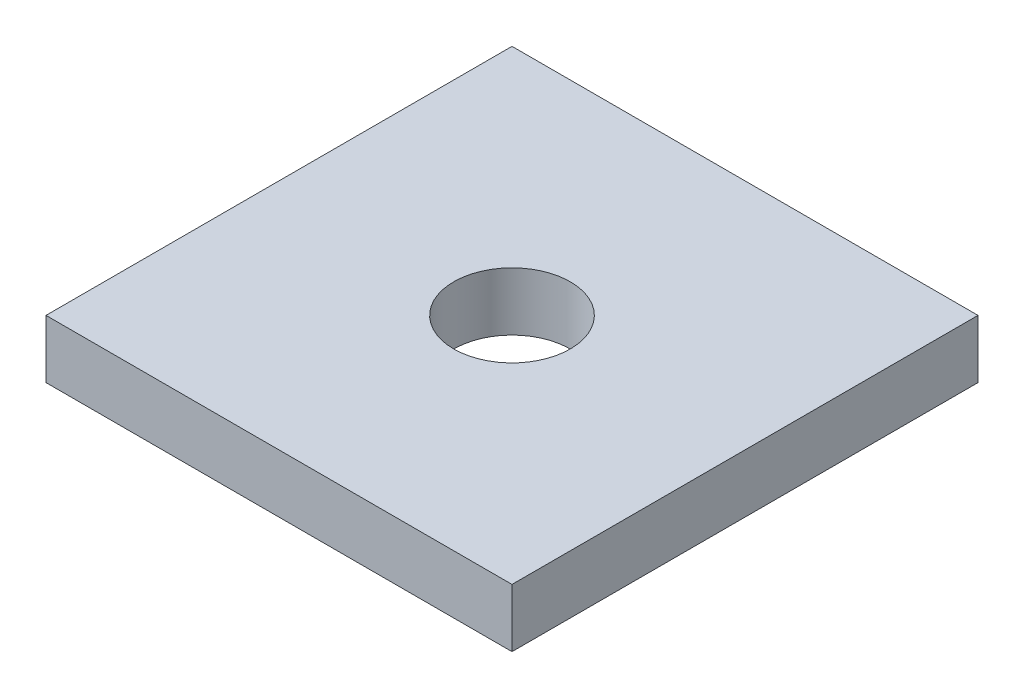
ISO-10303-21;
HEADER;
FILE_DESCRIPTION(('STEP AP214'),'2;1');
FILE_NAME('part.step','',(''),(''),'','','');
FILE_SCHEMA(('AUTOMOTIVE_DESIGN { 1 0 10303 214 1 1 1 1 }'));
ENDSEC;
DATA;
#1=APPLICATION_CONTEXT('core data for automotive mechanical design processes');
#2=APPLICATION_PROTOCOL_DEFINITION('international standard','automotive_design',2000,#1);
#3=PRODUCT_CONTEXT('',#1,'mechanical');
#4=PRODUCT('Part','Part','',(#3));
#5=PRODUCT_RELATED_PRODUCT_CATEGORY('part','',(#4));
#6=PRODUCT_DEFINITION_FORMATION('','',#4);
#7=PRODUCT_DEFINITION_CONTEXT('part definition',#1,'design');
#8=PRODUCT_DEFINITION('design','',#6,#7);
#9=PRODUCT_DEFINITION_SHAPE('','',#8);
#10=(LENGTH_UNIT() NAMED_UNIT(*) SI_UNIT(.MILLI.,.METRE.));
#11=(NAMED_UNIT(*) PLANE_ANGLE_UNIT() SI_UNIT($,.RADIAN.));
#12=(NAMED_UNIT(*) SI_UNIT($,.STERADIAN.) SOLID_ANGLE_UNIT());
#13=UNCERTAINTY_MEASURE_WITH_UNIT(LENGTH_MEASURE(1.E-05),#10,'distance_accuracy_value','');
#14=(GEOMETRIC_REPRESENTATION_CONTEXT(3) GLOBAL_UNCERTAINTY_ASSIGNED_CONTEXT((#13)) GLOBAL_UNIT_ASSIGNED_CONTEXT((#10,
#11,#12)) REPRESENTATION_CONTEXT('',''));
#15=CARTESIAN_POINT('',(0.,0.,0.));
#16=DIRECTION('',(0.,0.,1.));
#17=DIRECTION('',(1.,0.,0.));
#18=AXIS2_PLACEMENT_3D('',#15,#16,#17);
#19=CARTESIAN_POINT('',(-25.4,6.35,25.4));
#20=DIRECTION('',(0.,-1.,0.));
#21=DIRECTION('',(0.,0.,-1.));
#22=AXIS2_PLACEMENT_3D('',#19,#20,#21);
#23=PLANE('',#22);
#24=DIRECTION('',(0.,0.,1.));
#25=VECTOR('',#24,1.);
#26=CARTESIAN_POINT('',(-25.4,6.35,-25.4));
#27=LINE('',#26,#25);
#28=CARTESIAN_POINT('',(-25.4,6.35,-25.4));
#29=VERTEX_POINT('',#28);
#30=CARTESIAN_POINT('',(-25.4,6.35,25.4));
#31=VERTEX_POINT('',#30);
#32=EDGE_CURVE('E86',#29,#31,#27,.T.);
#33=ORIENTED_EDGE('',*,*,#32,.T.);
#34=DIRECTION('',(1.,0.,0.));
#35=VECTOR('',#34,1.);
#36=CARTESIAN_POINT('',(25.4,6.35,25.4));
#37=LINE('',#36,#35);
#38=CARTESIAN_POINT('',(25.4,6.35,25.4));
#39=VERTEX_POINT('',#38);
#40=EDGE_CURVE('E81',#31,#39,#37,.T.);
#41=ORIENTED_EDGE('',*,*,#40,.T.);
#42=DIRECTION('',(0.,0.,-1.));
#43=VECTOR('',#42,1.);
#44=CARTESIAN_POINT('',(25.4,6.35,-25.4));
#45=LINE('',#44,#43);
#46=CARTESIAN_POINT('',(25.4,6.35,-25.4));
#47=VERTEX_POINT('',#46);
#48=EDGE_CURVE('E84',#39,#47,#45,.T.);
#49=ORIENTED_EDGE('',*,*,#48,.T.);
#50=DIRECTION('',(-1.,0.,0.));
#51=VECTOR('',#50,1.);
#52=CARTESIAN_POINT('',(25.4,6.35,-25.4));
#53=LINE('',#52,#51);
#54=EDGE_CURVE('E51',#47,#29,#53,.T.);
#55=ORIENTED_EDGE('',*,*,#54,.T.);
#56=EDGE_LOOP('',(#33,#41,#49,#55));
#57=FACE_BOUND('',#56,.T.);
#58=CARTESIAN_POINT('',(0.,6.35,0.));
#59=DIRECTION('',(0.,1.,0.));
#60=DIRECTION('',(0.,0.,1.));
#61=AXIS2_PLACEMENT_3D('',#58,#59,#60);
#62=CIRCLE('',#61,6.35);
#63=CARTESIAN_POINT('',(0.,6.35,6.34999999999999));
#64=VERTEX_POINT('',#63);
#65=EDGE_CURVE('E101',#64,#64,#62,.T.);
#66=ORIENTED_EDGE('',*,*,#65,.F.);
#67=EDGE_LOOP('',(#66));
#68=FACE_BOUND('',#67,.T.);
#69=ADVANCED_FACE('F34',(#57,#68),#23,.F.);
#70=CARTESIAN_POINT('',(-25.4,0.,25.4));
#71=DIRECTION('',(0.,-1.,0.));
#72=DIRECTION('',(0.,0.,-1.));
#73=AXIS2_PLACEMENT_3D('',#70,#71,#72);
#74=PLANE('',#73);
#75=DIRECTION('',(0.,0.,1.));
#76=VECTOR('',#75,1.);
#77=CARTESIAN_POINT('',(-25.4,0.,-25.4));
#78=LINE('',#77,#76);
#79=CARTESIAN_POINT('',(-25.4,0.,-25.4));
#80=VERTEX_POINT('',#79);
#81=CARTESIAN_POINT('',(-25.4,0.,25.4));
#82=VERTEX_POINT('',#81);
#83=EDGE_CURVE('E98',#80,#82,#78,.T.);
#84=ORIENTED_EDGE('',*,*,#83,.F.);
#85=DIRECTION('',(-1.,0.,0.));
#86=VECTOR('',#85,1.);
#87=CARTESIAN_POINT('',(25.4,0.,-25.4));
#88=LINE('',#87,#86);
#89=CARTESIAN_POINT('',(25.4,0.,-25.4));
#90=VERTEX_POINT('',#89);
#91=EDGE_CURVE('E74',#90,#80,#88,.T.);
#92=ORIENTED_EDGE('',*,*,#91,.F.);
#93=DIRECTION('',(0.,0.,-1.));
#94=VECTOR('',#93,1.);
#95=CARTESIAN_POINT('',(25.4,0.,-25.4));
#96=LINE('',#95,#94);
#97=CARTESIAN_POINT('',(25.4,0.,25.4));
#98=VERTEX_POINT('',#97);
#99=EDGE_CURVE('E68',#98,#90,#96,.T.);
#100=ORIENTED_EDGE('',*,*,#99,.F.);
#101=DIRECTION('',(1.,0.,0.));
#102=VECTOR('',#101,1.);
#103=CARTESIAN_POINT('',(25.4,0.,25.4));
#104=LINE('',#103,#102);
#105=EDGE_CURVE('E90',#82,#98,#104,.T.);
#106=ORIENTED_EDGE('',*,*,#105,.F.);
#107=EDGE_LOOP('',(#84,#92,#100,#106));
#108=FACE_BOUND('',#107,.T.);
#109=CARTESIAN_POINT('',(0.,0.,0.));
#110=DIRECTION('',(0.,1.,0.));
#111=DIRECTION('',(0.,0.,1.));
#112=AXIS2_PLACEMENT_3D('',#109,#110,#111);
#113=CIRCLE('',#112,6.35);
#114=CARTESIAN_POINT('',(0.,0.,6.34999999999999));
#115=VERTEX_POINT('',#114);
#116=EDGE_CURVE('E113',#115,#115,#113,.T.);
#117=ORIENTED_EDGE('',*,*,#116,.T.);
#118=EDGE_LOOP('',(#117));
#119=FACE_BOUND('',#118,.T.);
#120=ADVANCED_FACE('F109',(#108,#119),#74,.T.);
#121=CARTESIAN_POINT('',(-25.4,6.35,-25.4));
#122=DIRECTION('',(1.,0.,0.));
#123=DIRECTION('',(0.,0.,-1.));
#124=AXIS2_PLACEMENT_3D('',#121,#122,#123);
#125=PLANE('',#124);
#126=ORIENTED_EDGE('',*,*,#83,.T.);
#127=DIRECTION('',(0.,-1.,0.));
#128=VECTOR('',#127,1.);
#129=CARTESIAN_POINT('',(-25.4,6.35,25.4));
#130=LINE('',#129,#128);
#131=EDGE_CURVE('E11',#31,#82,#130,.T.);
#132=ORIENTED_EDGE('',*,*,#131,.F.);
#133=ORIENTED_EDGE('',*,*,#32,.F.);
#134=DIRECTION('',(0.,-1.,0.));
#135=VECTOR('',#134,1.);
#136=CARTESIAN_POINT('',(-25.4,6.35,-25.4));
#137=LINE('',#136,#135);
#138=EDGE_CURVE('E94',#29,#80,#137,.T.);
#139=ORIENTED_EDGE('',*,*,#138,.T.);
#140=EDGE_LOOP('',(#126,#132,#133,#139));
#141=FACE_BOUND('',#140,.T.);
#142=ADVANCED_FACE('F36',(#141),#125,.F.);
#143=CARTESIAN_POINT('',(25.4,6.35,25.4));
#144=DIRECTION('',(0.,0.,-1.));
#145=DIRECTION('',(-1.,0.,0.));
#146=AXIS2_PLACEMENT_3D('',#143,#144,#145);
#147=PLANE('',#146);
#148=ORIENTED_EDGE('',*,*,#105,.T.);
#149=DIRECTION('',(0.,-1.,0.));
#150=VECTOR('',#149,1.);
#151=CARTESIAN_POINT('',(25.4,6.35,25.4));
#152=LINE('',#151,#150);
#153=EDGE_CURVE('E43',#39,#98,#152,.T.);
#154=ORIENTED_EDGE('',*,*,#153,.F.);
#155=ORIENTED_EDGE('',*,*,#40,.F.);
#156=ORIENTED_EDGE('',*,*,#131,.T.);
#157=EDGE_LOOP('',(#148,#154,#155,#156));
#158=FACE_BOUND('',#157,.T.);
#159=ADVANCED_FACE('F89',(#158),#147,.F.);
#160=CARTESIAN_POINT('',(25.4,6.35,-25.4));
#161=DIRECTION('',(-1.,0.,0.));
#162=DIRECTION('',(0.,0.,1.));
#163=AXIS2_PLACEMENT_3D('',#160,#161,#162);
#164=PLANE('',#163);
#165=ORIENTED_EDGE('',*,*,#99,.T.);
#166=DIRECTION('',(0.,-1.,0.));
#167=VECTOR('',#166,1.);
#168=CARTESIAN_POINT('',(25.4,6.35,-25.4));
#169=LINE('',#168,#167);
#170=EDGE_CURVE('E91',#47,#90,#169,.T.);
#171=ORIENTED_EDGE('',*,*,#170,.F.);
#172=ORIENTED_EDGE('',*,*,#48,.F.);
#173=ORIENTED_EDGE('',*,*,#153,.T.);
#174=EDGE_LOOP('',(#165,#171,#172,#173));
#175=FACE_BOUND('',#174,.T.);
#176=ADVANCED_FACE('F92',(#175),#164,.F.);
#177=CARTESIAN_POINT('',(25.4,6.35,-25.4));
#178=DIRECTION('',(0.,0.,1.));
#179=DIRECTION('',(1.,0.,0.));
#180=AXIS2_PLACEMENT_3D('',#177,#178,#179);
#181=PLANE('',#180);
#182=ORIENTED_EDGE('',*,*,#91,.T.);
#183=ORIENTED_EDGE('',*,*,#138,.F.);
#184=ORIENTED_EDGE('',*,*,#54,.F.);
#185=ORIENTED_EDGE('',*,*,#170,.T.);
#186=EDGE_LOOP('',(#182,#183,#184,#185));
#187=FACE_BOUND('',#186,.T.);
#188=ADVANCED_FACE('F106',(#187),#181,.F.);
#189=CARTESIAN_POINT('',(0.,6.35,0.));
#190=DIRECTION('',(0.,-1.,0.));
#191=DIRECTION('',(0.,0.,-1.));
#192=AXIS2_PLACEMENT_3D('',#189,#190,#191);
#193=CYLINDRICAL_SURFACE('',#192,6.35);
#194=ORIENTED_EDGE('',*,*,#65,.T.);
#195=EDGE_LOOP('',(#194));
#196=FACE_BOUND('',#195,.T.);
#197=ORIENTED_EDGE('',*,*,#116,.F.);
#198=EDGE_LOOP('',(#197));
#199=FACE_BOUND('',#198,.T.);
#200=ADVANCED_FACE('F119',(#196,#199),#193,.F.);
#201=CLOSED_SHELL('',(#69,#120,#142,#159,#176,#188,#200));
#202=MANIFOLD_SOLID_BREP('B2',#201);
#203=ADVANCED_BREP_SHAPE_REPRESENTATION('',(#18,#202),#14);
#204=SHAPE_DEFINITION_REPRESENTATION(#9,#203);
ENDSEC;
END-ISO-10303-21;
